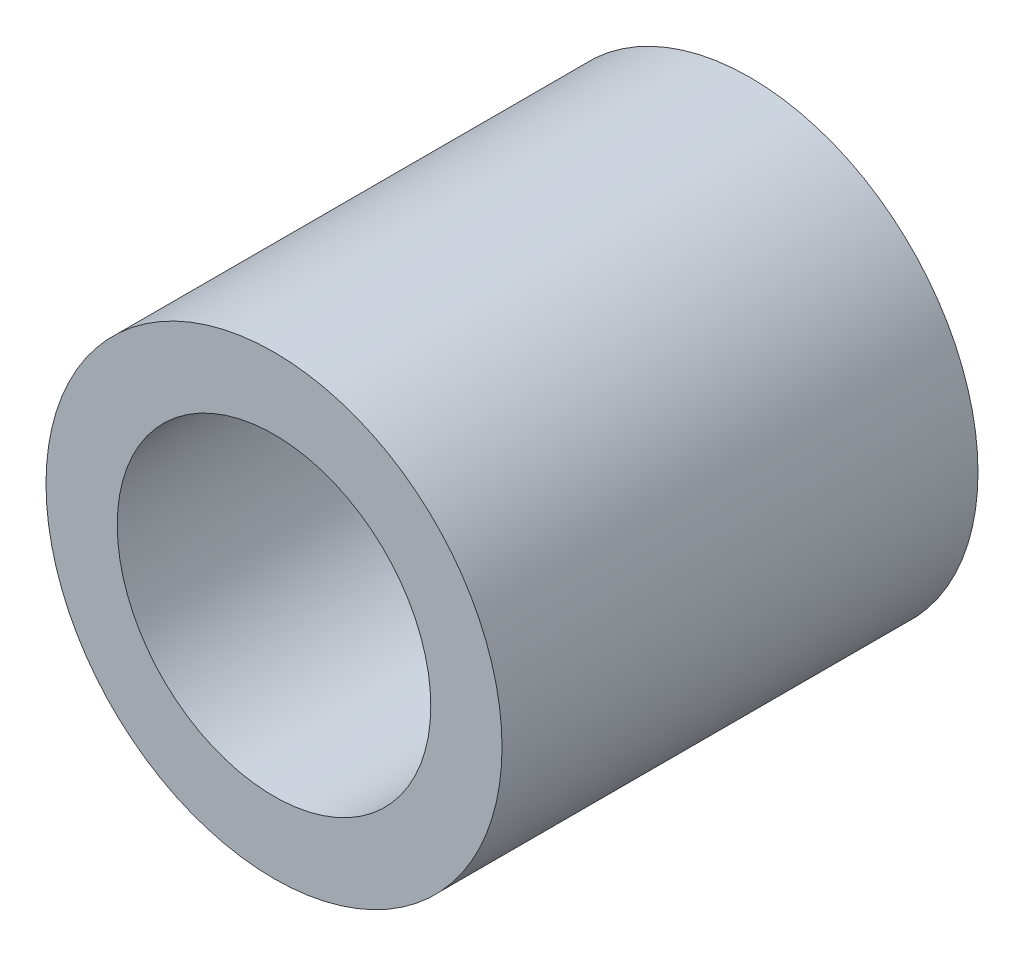
ISO-10303-21;
HEADER;
FILE_DESCRIPTION(('STEP AP214'),'2;1');
FILE_NAME('part.step','',(''),(''),'','','');
FILE_SCHEMA(('AUTOMOTIVE_DESIGN { 1 0 10303 214 1 1 1 1 }'));
ENDSEC;
DATA;
#1=APPLICATION_CONTEXT('core data for automotive mechanical design processes');
#2=APPLICATION_PROTOCOL_DEFINITION('international standard','automotive_design',2000,#1);
#3=PRODUCT_CONTEXT('',#1,'mechanical');
#4=PRODUCT('Part','Part','',(#3));
#5=PRODUCT_RELATED_PRODUCT_CATEGORY('part','',(#4));
#6=PRODUCT_DEFINITION_FORMATION('','',#4);
#7=PRODUCT_DEFINITION_CONTEXT('part definition',#1,'design');
#8=PRODUCT_DEFINITION('design','',#6,#7);
#9=PRODUCT_DEFINITION_SHAPE('','',#8);
#10=(LENGTH_UNIT() NAMED_UNIT(*) SI_UNIT(.MILLI.,.METRE.));
#11=(NAMED_UNIT(*) PLANE_ANGLE_UNIT() SI_UNIT($,.RADIAN.));
#12=(NAMED_UNIT(*) SI_UNIT($,.STERADIAN.) SOLID_ANGLE_UNIT());
#13=UNCERTAINTY_MEASURE_WITH_UNIT(LENGTH_MEASURE(1.E-05),#10,'distance_accuracy_value','');
#14=(GEOMETRIC_REPRESENTATION_CONTEXT(3) GLOBAL_UNCERTAINTY_ASSIGNED_CONTEXT((#13)) GLOBAL_UNIT_ASSIGNED_CONTEXT((#10,
#11,#12)) REPRESENTATION_CONTEXT('',''));
#15=CARTESIAN_POINT('',(0.,0.,0.));
#16=DIRECTION('',(0.,0.,1.));
#17=DIRECTION('',(1.,0.,0.));
#18=AXIS2_PLACEMENT_3D('',#15,#16,#17);
#19=CARTESIAN_POINT('',(0.,0.,0.));
#20=DIRECTION('',(0.,0.,1.));
#21=DIRECTION('',(1.,0.,0.));
#22=AXIS2_PLACEMENT_3D('',#19,#20,#21);
#23=CYLINDRICAL_SURFACE('',#22,2.75);
#24=CARTESIAN_POINT('',(0.,0.,8.35));
#25=DIRECTION('',(0.,0.,1.));
#26=DIRECTION('',(1.,0.,0.));
#27=AXIS2_PLACEMENT_3D('',#24,#25,#26);
#28=CIRCLE('',#27,2.75);
#29=CARTESIAN_POINT('',(2.75,0.,8.35));
#30=VERTEX_POINT('',#29);
#31=EDGE_CURVE('E16',#30,#30,#28,.F.);
#32=ORIENTED_EDGE('',*,*,#31,.F.);
#33=EDGE_LOOP('',(#32));
#34=FACE_BOUND('',#33,.T.);
#35=CARTESIAN_POINT('',(0.,0.,0.));
#36=DIRECTION('',(0.,0.,1.));
#37=DIRECTION('',(1.,0.,0.));
#38=AXIS2_PLACEMENT_3D('',#35,#36,#37);
#39=CIRCLE('',#38,2.75);
#40=CARTESIAN_POINT('',(2.75,0.,0.));
#41=VERTEX_POINT('',#40);
#42=EDGE_CURVE('E25',#41,#41,#39,.F.);
#43=ORIENTED_EDGE('',*,*,#42,.T.);
#44=EDGE_LOOP('',(#43));
#45=FACE_BOUND('',#44,.T.);
#46=ADVANCED_FACE('F13',(#34,#45),#23,.F.);
#47=CARTESIAN_POINT('',(0.,0.,8.35));
#48=DIRECTION('',(0.,0.,1.));
#49=DIRECTION('',(1.,0.,0.));
#50=AXIS2_PLACEMENT_3D('',#47,#48,#49);
#51=PLANE('',#50);
#52=ORIENTED_EDGE('',*,*,#31,.T.);
#53=EDGE_LOOP('',(#52));
#54=FACE_BOUND('',#53,.T.);
#55=CARTESIAN_POINT('',(0.,0.,8.35));
#56=DIRECTION('',(0.,0.,1.));
#57=DIRECTION('',(1.,0.,0.));
#58=AXIS2_PLACEMENT_3D('',#55,#56,#57);
#59=CIRCLE('',#58,4.);
#60=CARTESIAN_POINT('',(4.,0.,8.35));
#61=VERTEX_POINT('',#60);
#62=EDGE_CURVE('E20',#61,#61,#59,.F.);
#63=ORIENTED_EDGE('',*,*,#62,.F.);
#64=EDGE_LOOP('',(#63));
#65=FACE_BOUND('',#64,.T.);
#66=ADVANCED_FACE('F33',(#54,#65),#51,.T.);
#67=CARTESIAN_POINT('',(0.,0.,0.));
#68=DIRECTION('',(0.,0.,1.));
#69=DIRECTION('',(1.,0.,0.));
#70=AXIS2_PLACEMENT_3D('',#67,#68,#69);
#71=PLANE('',#70);
#72=ORIENTED_EDGE('',*,*,#42,.F.);
#73=EDGE_LOOP('',(#72));
#74=FACE_BOUND('',#73,.T.);
#75=CARTESIAN_POINT('',(0.,0.,0.));
#76=DIRECTION('',(0.,0.,1.));
#77=DIRECTION('',(1.,0.,0.));
#78=AXIS2_PLACEMENT_3D('',#75,#76,#77);
#79=CIRCLE('',#78,4.);
#80=CARTESIAN_POINT('',(4.,0.,0.));
#81=VERTEX_POINT('',#80);
#82=EDGE_CURVE('E9',#81,#81,#79,.T.);
#83=ORIENTED_EDGE('',*,*,#82,.F.);
#84=EDGE_LOOP('',(#83));
#85=FACE_BOUND('',#84,.T.);
#86=ADVANCED_FACE('F41',(#74,#85),#71,.F.);
#87=CARTESIAN_POINT('',(0.,0.,0.));
#88=DIRECTION('',(0.,0.,1.));
#89=DIRECTION('',(1.,0.,0.));
#90=AXIS2_PLACEMENT_3D('',#87,#88,#89);
#91=CYLINDRICAL_SURFACE('',#90,4.);
#92=ORIENTED_EDGE('',*,*,#62,.T.);
#93=EDGE_LOOP('',(#92));
#94=FACE_BOUND('',#93,.T.);
#95=ORIENTED_EDGE('',*,*,#82,.T.);
#96=EDGE_LOOP('',(#95));
#97=FACE_BOUND('',#96,.T.);
#98=ADVANCED_FACE('F42',(#94,#97),#91,.T.);
#99=CLOSED_SHELL('',(#46,#66,#86,#98));
#100=MANIFOLD_SOLID_BREP('B1',#99);
#101=ADVANCED_BREP_SHAPE_REPRESENTATION('',(#18,#100),#14);
#102=SHAPE_DEFINITION_REPRESENTATION(#9,#101);
ENDSEC;
END-ISO-10303-21;
